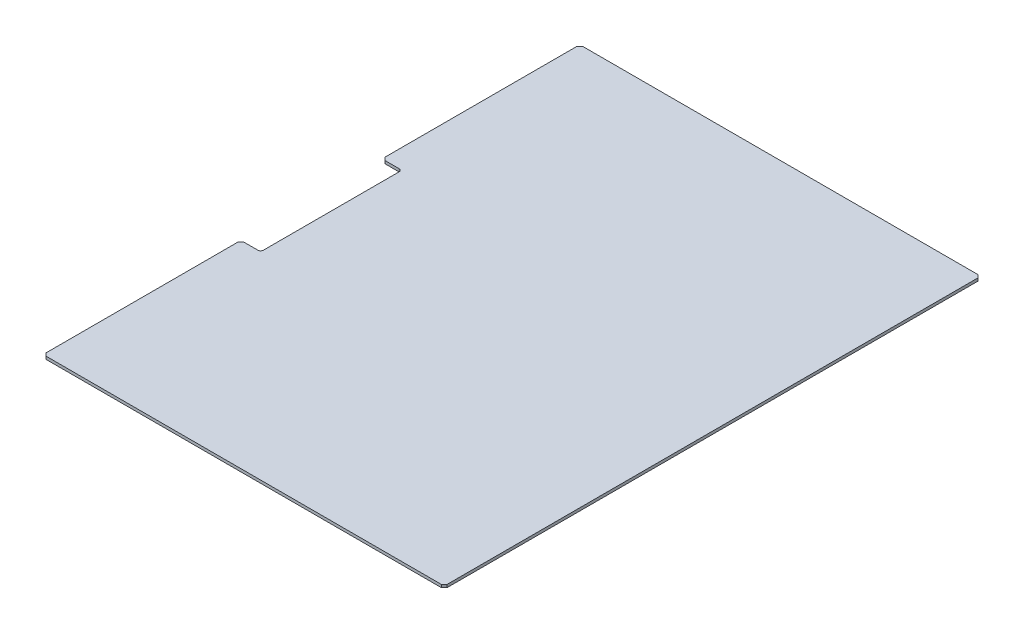
ISO-10303-21;
HEADER;
FILE_DESCRIPTION(('STEP AP214'),'2;1');
FILE_NAME('part.step','',(''),(''),'','','');
FILE_SCHEMA(('AUTOMOTIVE_DESIGN { 1 0 10303 214 1 1 1 1 }'));
ENDSEC;
DATA;
#1=APPLICATION_CONTEXT('core data for automotive mechanical design processes');
#2=APPLICATION_PROTOCOL_DEFINITION('international standard','automotive_design',2000,#1);
#3=PRODUCT_CONTEXT('',#1,'mechanical');
#4=PRODUCT('Part','Part','',(#3));
#5=PRODUCT_RELATED_PRODUCT_CATEGORY('part','',(#4));
#6=PRODUCT_DEFINITION_FORMATION('','',#4);
#7=PRODUCT_DEFINITION_CONTEXT('part definition',#1,'design');
#8=PRODUCT_DEFINITION('design','',#6,#7);
#9=PRODUCT_DEFINITION_SHAPE('','',#8);
#10=(LENGTH_UNIT() NAMED_UNIT(*) SI_UNIT(.MILLI.,.METRE.));
#11=(NAMED_UNIT(*) PLANE_ANGLE_UNIT() SI_UNIT($,.RADIAN.));
#12=(NAMED_UNIT(*) SI_UNIT($,.STERADIAN.) SOLID_ANGLE_UNIT());
#13=UNCERTAINTY_MEASURE_WITH_UNIT(LENGTH_MEASURE(1.E-05),#10,'distance_accuracy_value','');
#14=(GEOMETRIC_REPRESENTATION_CONTEXT(3) GLOBAL_UNCERTAINTY_ASSIGNED_CONTEXT((#13)) GLOBAL_UNIT_ASSIGNED_CONTEXT((#10,
#11,#12)) REPRESENTATION_CONTEXT('',''));
#15=CARTESIAN_POINT('',(0.,0.,0.));
#16=DIRECTION('',(0.,0.,1.));
#17=DIRECTION('',(1.,0.,0.));
#18=AXIS2_PLACEMENT_3D('',#15,#16,#17);
#19=CARTESIAN_POINT('',(50.8,-6.35,52.5536723434925));
#20=DIRECTION('',(-1.,0.,0.));
#21=DIRECTION('',(0.,0.,1.));
#22=AXIS2_PLACEMENT_3D('',#19,#20,#21);
#23=PLANE('',#22);
#24=DIRECTION('',(0.,0.,1.));
#25=VECTOR('',#24,1.);
#26=CARTESIAN_POINT('',(50.8,0.,52.5536723434925));
#27=LINE('',#26,#25);
#28=CARTESIAN_POINT('',(50.8,0.,768.35));
#29=VERTEX_POINT('',#28);
#30=CARTESIAN_POINT('',(50.8,0.,1200.15));
#31=VERTEX_POINT('',#30);
#32=EDGE_CURVE('E197',#29,#31,#27,.T.);
#33=ORIENTED_EDGE('',*,*,#32,.F.);
#34=DIRECTION('',(0.,-1.,0.));
#35=VECTOR('',#34,1.);
#36=CARTESIAN_POINT('',(50.8,-6.35,768.35));
#37=LINE('',#36,#35);
#38=CARTESIAN_POINT('',(50.8,-6.35,768.35));
#39=VERTEX_POINT('',#38);
#40=EDGE_CURVE('E171',#29,#39,#37,.T.);
#41=ORIENTED_EDGE('',*,*,#40,.T.);
#42=DIRECTION('',(0.,0.,1.));
#43=VECTOR('',#42,1.);
#44=CARTESIAN_POINT('',(50.8,-6.35,52.5536723434925));
#45=LINE('',#44,#43);
#46=CARTESIAN_POINT('',(50.8,-6.35,1200.15));
#47=VERTEX_POINT('',#46);
#48=EDGE_CURVE('E225',#39,#47,#45,.T.);
#49=ORIENTED_EDGE('',*,*,#48,.T.);
#50=DIRECTION('',(0.,1.,0.));
#51=VECTOR('',#50,1.);
#52=CARTESIAN_POINT('',(50.8,-6.35,1200.15));
#53=LINE('',#52,#51);
#54=EDGE_CURVE('E177',#47,#31,#53,.T.);
#55=ORIENTED_EDGE('',*,*,#54,.T.);
#56=EDGE_LOOP('',(#33,#41,#49,#55));
#57=FACE_BOUND('',#56,.T.);
#58=ADVANCED_FACE('F16',(#57),#23,.T.);
#59=CARTESIAN_POINT('',(121.105415511131,-6.35,762.));
#60=DIRECTION('',(0.,0.,1.));
#61=DIRECTION('',(1.,0.,0.));
#62=AXIS2_PLACEMENT_3D('',#59,#60,#61);
#63=PLANE('',#62);
#64=DIRECTION('',(1.,0.,0.));
#65=VECTOR('',#64,1.);
#66=CARTESIAN_POINT('',(121.105415511131,0.,762.));
#67=LINE('',#66,#65);
#68=CARTESIAN_POINT('',(57.15,0.,762.));
#69=VERTEX_POINT('',#68);
#70=CARTESIAN_POINT('',(88.9,0.,762.));
#71=VERTEX_POINT('',#70);
#72=EDGE_CURVE('E184',#69,#71,#67,.T.);
#73=ORIENTED_EDGE('',*,*,#72,.T.);
#74=DIRECTION('',(0.,1.,0.));
#75=VECTOR('',#74,1.);
#76=CARTESIAN_POINT('',(88.9,-6.35,762.));
#77=LINE('',#76,#75);
#78=CARTESIAN_POINT('',(88.9,-6.35,762.));
#79=VERTEX_POINT('',#78);
#80=EDGE_CURVE('E300',#71,#79,#77,.F.);
#81=ORIENTED_EDGE('',*,*,#80,.T.);
#82=DIRECTION('',(1.,0.,0.));
#83=VECTOR('',#82,1.);
#84=CARTESIAN_POINT('',(121.105415511131,-6.35,762.));
#85=LINE('',#84,#83);
#86=CARTESIAN_POINT('',(57.15,-6.35,762.));
#87=VERTEX_POINT('',#86);
#88=EDGE_CURVE('E187',#87,#79,#85,.T.);
#89=ORIENTED_EDGE('',*,*,#88,.F.);
#90=DIRECTION('',(0.,1.,0.));
#91=VECTOR('',#90,1.);
#92=CARTESIAN_POINT('',(57.15,0.,762.));
#93=LINE('',#92,#91);
#94=EDGE_CURVE('E170',#87,#69,#93,.T.);
#95=ORIENTED_EDGE('',*,*,#94,.T.);
#96=EDGE_LOOP('',(#73,#81,#89,#95));
#97=FACE_BOUND('',#96,.T.);
#98=ADVANCED_FACE('F183',(#97),#63,.F.);
#99=CARTESIAN_POINT('',(95.25,-6.35,626.005172729492));
#100=DIRECTION('',(1.,0.,0.));
#101=DIRECTION('',(0.,0.,-1.));
#102=AXIS2_PLACEMENT_3D('',#99,#100,#101);
#103=PLANE('',#102);
#104=DIRECTION('',(0.,0.,-1.));
#105=VECTOR('',#104,1.);
#106=CARTESIAN_POINT('',(95.25,-6.35,626.005172729492));
#107=LINE('',#106,#105);
#108=CARTESIAN_POINT('',(95.25,-6.35,755.65));
#109=VERTEX_POINT('',#108);
#110=CARTESIAN_POINT('',(95.25,-6.35,450.85));
#111=VERTEX_POINT('',#110);
#112=EDGE_CURVE('E324',#109,#111,#107,.T.);
#113=ORIENTED_EDGE('',*,*,#112,.F.);
#114=DIRECTION('',(0.,1.,0.));
#115=VECTOR('',#114,1.);
#116=CARTESIAN_POINT('',(95.25,0.,755.65));
#117=LINE('',#116,#115);
#118=CARTESIAN_POINT('',(95.25,0.,755.65));
#119=VERTEX_POINT('',#118);
#120=EDGE_CURVE('E296',#109,#119,#117,.T.);
#121=ORIENTED_EDGE('',*,*,#120,.T.);
#122=DIRECTION('',(0.,0.,-1.));
#123=VECTOR('',#122,1.);
#124=CARTESIAN_POINT('',(95.25,0.,626.005172729492));
#125=LINE('',#124,#123);
#126=CARTESIAN_POINT('',(95.25,0.,450.85));
#127=VERTEX_POINT('',#126);
#128=EDGE_CURVE('E196',#119,#127,#125,.T.);
#129=ORIENTED_EDGE('',*,*,#128,.T.);
#130=DIRECTION('',(0.,1.,0.));
#131=VECTOR('',#130,1.);
#132=CARTESIAN_POINT('',(95.25,-6.35,450.85));
#133=LINE('',#132,#131);
#134=EDGE_CURVE('E293',#127,#111,#133,.F.);
#135=ORIENTED_EDGE('',*,*,#134,.T.);
#136=EDGE_LOOP('',(#113,#121,#129,#135));
#137=FACE_BOUND('',#136,.T.);
#138=ADVANCED_FACE('F315',(#137),#103,.F.);
#139=CARTESIAN_POINT('',(121.105415511131,-6.35,444.5));
#140=DIRECTION('',(0.,0.,1.));
#141=DIRECTION('',(1.,0.,0.));
#142=AXIS2_PLACEMENT_3D('',#139,#140,#141);
#143=PLANE('',#142);
#144=DIRECTION('',(1.,0.,0.));
#145=VECTOR('',#144,1.);
#146=CARTESIAN_POINT('',(121.105415511131,-6.35,444.5));
#147=LINE('',#146,#145);
#148=CARTESIAN_POINT('',(57.15,-6.35,444.5));
#149=VERTEX_POINT('',#148);
#150=CARTESIAN_POINT('',(88.9,-6.35,444.5));
#151=VERTEX_POINT('',#150);
#152=EDGE_CURVE('E320',#149,#151,#147,.T.);
#153=ORIENTED_EDGE('',*,*,#152,.T.);
#154=DIRECTION('',(0.,1.,0.));
#155=VECTOR('',#154,1.);
#156=CARTESIAN_POINT('',(88.9,-6.35,444.5));
#157=LINE('',#156,#155);
#158=CARTESIAN_POINT('',(88.9,0.,444.5));
#159=VERTEX_POINT('',#158);
#160=EDGE_CURVE('E303',#151,#159,#157,.T.);
#161=ORIENTED_EDGE('',*,*,#160,.T.);
#162=DIRECTION('',(1.,0.,0.));
#163=VECTOR('',#162,1.);
#164=CARTESIAN_POINT('',(121.105415511131,0.,444.5));
#165=LINE('',#164,#163);
#166=CARTESIAN_POINT('',(57.15,0.,444.5));
#167=VERTEX_POINT('',#166);
#168=EDGE_CURVE('E204',#167,#159,#165,.T.);
#169=ORIENTED_EDGE('',*,*,#168,.F.);
#170=DIRECTION('',(0.,-1.,0.));
#171=VECTOR('',#170,1.);
#172=CARTESIAN_POINT('',(57.15,-6.35,444.5));
#173=LINE('',#172,#171);
#174=EDGE_CURVE('E269',#167,#149,#173,.T.);
#175=ORIENTED_EDGE('',*,*,#174,.T.);
#176=EDGE_LOOP('',(#153,#161,#169,#175));
#177=FACE_BOUND('',#176,.T.);
#178=ADVANCED_FACE('F318',(#177),#143,.T.);
#179=CARTESIAN_POINT('',(50.8,-6.35,6.35));
#180=VERTEX_POINT('',#179);
#181=CARTESIAN_POINT('',(50.8,-6.35,438.15));
#182=VERTEX_POINT('',#181);
#183=EDGE_CURVE('E323',#180,#182,#45,.T.);
#184=ORIENTED_EDGE('',*,*,#183,.T.);
#185=DIRECTION('',(0.,1.,0.));
#186=VECTOR('',#185,1.);
#187=CARTESIAN_POINT('',(50.8,-6.35,438.15));
#188=LINE('',#187,#186);
#189=CARTESIAN_POINT('',(50.8,0.,438.15));
#190=VERTEX_POINT('',#189);
#191=EDGE_CURVE('E265',#182,#190,#188,.T.);
#192=ORIENTED_EDGE('',*,*,#191,.T.);
#193=CARTESIAN_POINT('',(50.8,0.,6.35));
#194=VERTEX_POINT('',#193);
#195=EDGE_CURVE('E208',#194,#190,#27,.T.);
#196=ORIENTED_EDGE('',*,*,#195,.F.);
#197=DIRECTION('',(0.,-1.,0.));
#198=VECTOR('',#197,1.);
#199=CARTESIAN_POINT('',(50.8,-6.35,6.35));
#200=LINE('',#199,#198);
#201=EDGE_CURVE('E262',#194,#180,#200,.T.);
#202=ORIENTED_EDGE('',*,*,#201,.T.);
#203=EDGE_LOOP('',(#184,#192,#196,#202));
#204=FACE_BOUND('',#203,.T.);
#205=ADVANCED_FACE('F376',(#204),#23,.T.);
#206=CARTESIAN_POINT('',(123.701680451632,-6.35,0.));
#207=DIRECTION('',(0.,0.,1.));
#208=DIRECTION('',(1.,0.,0.));
#209=AXIS2_PLACEMENT_3D('',#206,#207,#208);
#210=PLANE('',#209);
#211=DIRECTION('',(1.,0.,0.));
#212=VECTOR('',#211,1.);
#213=CARTESIAN_POINT('',(123.701680451632,-6.35,0.));
#214=LINE('',#213,#212);
#215=CARTESIAN_POINT('',(57.15,-6.35,0.));
#216=VERTEX_POINT('',#215);
#217=CARTESIAN_POINT('',(946.15,-6.35,0.));
#218=VERTEX_POINT('',#217);
#219=EDGE_CURVE('E329',#216,#218,#214,.T.);
#220=ORIENTED_EDGE('',*,*,#219,.F.);
#221=DIRECTION('',(0.,1.,0.));
#222=VECTOR('',#221,1.);
#223=CARTESIAN_POINT('',(57.15,0.,0.));
#224=LINE('',#223,#222);
#225=CARTESIAN_POINT('',(57.15,0.,0.));
#226=VERTEX_POINT('',#225);
#227=EDGE_CURVE('E275',#216,#226,#224,.T.);
#228=ORIENTED_EDGE('',*,*,#227,.T.);
#229=DIRECTION('',(1.,0.,0.));
#230=VECTOR('',#229,1.);
#231=CARTESIAN_POINT('',(123.701680451632,0.,0.));
#232=LINE('',#231,#230);
#233=CARTESIAN_POINT('',(946.15,0.,0.));
#234=VERTEX_POINT('',#233);
#235=EDGE_CURVE('E214',#226,#234,#232,.T.);
#236=ORIENTED_EDGE('',*,*,#235,.T.);
#237=DIRECTION('',(0.,-1.,0.));
#238=VECTOR('',#237,1.);
#239=CARTESIAN_POINT('',(946.15,-6.35,0.));
#240=LINE('',#239,#238);
#241=EDGE_CURVE('E272',#234,#218,#240,.T.);
#242=ORIENTED_EDGE('',*,*,#241,.T.);
#243=EDGE_LOOP('',(#220,#228,#236,#242));
#244=FACE_BOUND('',#243,.T.);
#245=ADVANCED_FACE('F367',(#244),#210,.F.);
#246=CARTESIAN_POINT('',(952.5,-6.35,52.5536723434928));
#247=DIRECTION('',(-1.,0.,0.));
#248=DIRECTION('',(0.,0.,1.));
#249=AXIS2_PLACEMENT_3D('',#246,#247,#248);
#250=PLANE('',#249);
#251=DIRECTION('',(0.,0.,1.));
#252=VECTOR('',#251,1.);
#253=CARTESIAN_POINT('',(952.5,-6.35,52.5536723434928));
#254=LINE('',#253,#252);
#255=CARTESIAN_POINT('',(952.5,-6.35,6.35));
#256=VERTEX_POINT('',#255);
#257=CARTESIAN_POINT('',(952.5,-6.35,1200.15));
#258=VERTEX_POINT('',#257);
#259=EDGE_CURVE('E338',#256,#258,#254,.T.);
#260=ORIENTED_EDGE('',*,*,#259,.F.);
#261=DIRECTION('',(0.,1.,0.));
#262=VECTOR('',#261,1.);
#263=CARTESIAN_POINT('',(952.5,-6.35,6.35));
#264=LINE('',#263,#262);
#265=CARTESIAN_POINT('',(952.5,0.,6.35));
#266=VERTEX_POINT('',#265);
#267=EDGE_CURVE('E282',#256,#266,#264,.T.);
#268=ORIENTED_EDGE('',*,*,#267,.T.);
#269=DIRECTION('',(0.,0.,1.));
#270=VECTOR('',#269,1.);
#271=CARTESIAN_POINT('',(952.5,0.,52.5536723434928));
#272=LINE('',#271,#270);
#273=CARTESIAN_POINT('',(952.5,0.,1200.15));
#274=VERTEX_POINT('',#273);
#275=EDGE_CURVE('E218',#266,#274,#272,.T.);
#276=ORIENTED_EDGE('',*,*,#275,.T.);
#277=DIRECTION('',(0.,-1.,0.));
#278=VECTOR('',#277,1.);
#279=CARTESIAN_POINT('',(952.5,-6.35,1200.15));
#280=LINE('',#279,#278);
#281=EDGE_CURVE('E279',#274,#258,#280,.T.);
#282=ORIENTED_EDGE('',*,*,#281,.T.);
#283=EDGE_LOOP('',(#260,#268,#276,#282));
#284=FACE_BOUND('',#283,.T.);
#285=ADVANCED_FACE('F358',(#284),#250,.F.);
#286=CARTESIAN_POINT('',(123.701680451632,-6.35,1206.5));
#287=DIRECTION('',(0.,0.,1.));
#288=DIRECTION('',(1.,0.,0.));
#289=AXIS2_PLACEMENT_3D('',#286,#287,#288);
#290=PLANE('',#289);
#291=DIRECTION('',(1.,0.,0.));
#292=VECTOR('',#291,1.);
#293=CARTESIAN_POINT('',(123.701680451632,0.,1206.5));
#294=LINE('',#293,#292);
#295=CARTESIAN_POINT('',(57.15,0.,1206.5));
#296=VERTEX_POINT('',#295);
#297=CARTESIAN_POINT('',(946.15,0.,1206.5));
#298=VERTEX_POINT('',#297);
#299=EDGE_CURVE('E222',#296,#298,#294,.T.);
#300=ORIENTED_EDGE('',*,*,#299,.F.);
#301=DIRECTION('',(0.,-1.,0.));
#302=VECTOR('',#301,1.);
#303=CARTESIAN_POINT('',(57.15,-6.35,1206.5));
#304=LINE('',#303,#302);
#305=CARTESIAN_POINT('',(57.15,-6.35,1206.5));
#306=VERTEX_POINT('',#305);
#307=EDGE_CURVE('E290',#296,#306,#304,.T.);
#308=ORIENTED_EDGE('',*,*,#307,.T.);
#309=DIRECTION('',(1.,0.,0.));
#310=VECTOR('',#309,1.);
#311=CARTESIAN_POINT('',(123.701680451632,-6.35,1206.5));
#312=LINE('',#311,#310);
#313=CARTESIAN_POINT('',(946.15,-6.35,1206.5));
#314=VERTEX_POINT('',#313);
#315=EDGE_CURVE('E190',#306,#314,#312,.T.);
#316=ORIENTED_EDGE('',*,*,#315,.T.);
#317=DIRECTION('',(0.,1.,0.));
#318=VECTOR('',#317,1.);
#319=CARTESIAN_POINT('',(946.15,0.,1206.5));
#320=LINE('',#319,#318);
#321=EDGE_CURVE('E286',#314,#298,#320,.T.);
#322=ORIENTED_EDGE('',*,*,#321,.T.);
#323=EDGE_LOOP('',(#300,#308,#316,#322));
#324=FACE_BOUND('',#323,.T.);
#325=ADVANCED_FACE('F348',(#324),#290,.T.);
#326=CARTESIAN_POINT('',(501.65,-6.35,603.25));
#327=DIRECTION('',(0.,-1.,0.));
#328=DIRECTION('',(1.,0.,0.));
#329=AXIS2_PLACEMENT_3D('',#326,#327,#328);
#330=PLANE('',#329);
#331=ORIENTED_EDGE('',*,*,#48,.F.);
#332=DIRECTION('',(0.707106781186557,0.,-0.707106781186538));
#333=VECTOR('',#332,1.);
#334=CARTESIAN_POINT('',(358.775000000005,-6.35,460.375));
#335=LINE('',#334,#333);
#336=EDGE_CURVE('E259',#39,#87,#335,.T.);
#337=ORIENTED_EDGE('',*,*,#336,.T.);
#338=ORIENTED_EDGE('',*,*,#88,.T.);
#339=CARTESIAN_POINT('',(88.9,-6.35,755.65));
#340=DIRECTION('',(0.,-1.,0.));
#341=DIRECTION('',(0.,0.,-1.));
#342=AXIS2_PLACEMENT_3D('',#339,#340,#341);
#343=CIRCLE('',#342,6.35);
#344=EDGE_CURVE('E308',#79,#109,#343,.F.);
#345=ORIENTED_EDGE('',*,*,#344,.T.);
#346=ORIENTED_EDGE('',*,*,#112,.T.);
#347=CARTESIAN_POINT('',(88.9,-6.35,450.85));
#348=DIRECTION('',(0.,-1.,0.));
#349=DIRECTION('',(0.,0.,-1.));
#350=AXIS2_PLACEMENT_3D('',#347,#348,#349);
#351=CIRCLE('',#350,6.35);
#352=EDGE_CURVE('E11',#111,#151,#351,.F.);
#353=ORIENTED_EDGE('',*,*,#352,.T.);
#354=ORIENTED_EDGE('',*,*,#152,.F.);
#355=DIRECTION('',(0.707106781186547,0.,0.707106781186548));
#356=VECTOR('',#355,1.);
#357=CARTESIAN_POINT('',(358.775,-6.35,746.125));
#358=LINE('',#357,#356);
#359=EDGE_CURVE('E256',#149,#182,#358,.F.);
#360=ORIENTED_EDGE('',*,*,#359,.T.);
#361=ORIENTED_EDGE('',*,*,#183,.F.);
#362=DIRECTION('',(0.707106781186548,0.,-0.707106781186548));
#363=VECTOR('',#362,1.);
#364=CARTESIAN_POINT('',(-22.225,-6.35,79.375));
#365=LINE('',#364,#363);
#366=EDGE_CURVE('E253',#180,#216,#365,.T.);
#367=ORIENTED_EDGE('',*,*,#366,.T.);
#368=ORIENTED_EDGE('',*,*,#219,.T.);
#369=DIRECTION('',(-0.707106781186545,0.,-0.70710678118655));
#370=VECTOR('',#369,1.);
#371=CARTESIAN_POINT('',(1025.525,-6.35,79.375000000002));
#372=LINE('',#371,#370);
#373=EDGE_CURVE('E250',#218,#256,#372,.F.);
#374=ORIENTED_EDGE('',*,*,#373,.T.);
#375=ORIENTED_EDGE('',*,*,#259,.T.);
#376=DIRECTION('',(-0.707106781186529,0.,0.707106781186566));
#377=VECTOR('',#376,1.);
#378=CARTESIAN_POINT('',(1025.52500000001,-6.35,1127.12499999998));
#379=LINE('',#378,#377);
#380=EDGE_CURVE('E244',#258,#314,#379,.T.);
#381=ORIENTED_EDGE('',*,*,#380,.T.);
#382=ORIENTED_EDGE('',*,*,#315,.F.);
#383=DIRECTION('',(0.707106781186532,0.,0.707106781186563));
#384=VECTOR('',#383,1.);
#385=CARTESIAN_POINT('',(-22.2250000000101,-6.35,1127.12499999999));
#386=LINE('',#385,#384);
#387=EDGE_CURVE('E247',#306,#47,#386,.F.);
#388=ORIENTED_EDGE('',*,*,#387,.T.);
#389=EDGE_LOOP('',(#331,#337,#338,#345,#346,#353,#354,#360,#361,#367,#368,#374,#375,#381,#382,#388));
#390=FACE_BOUND('',#389,.T.);
#391=ADVANCED_FACE('F468',(#390),#330,.T.);
#392=CARTESIAN_POINT('',(501.65,0.,603.25));
#393=DIRECTION('',(0.,-1.,0.));
#394=DIRECTION('',(1.,0.,0.));
#395=AXIS2_PLACEMENT_3D('',#392,#393,#394);
#396=PLANE('',#395);
#397=ORIENTED_EDGE('',*,*,#72,.F.);
#398=DIRECTION('',(-0.707106781186557,0.,0.707106781186538));
#399=VECTOR('',#398,1.);
#400=CARTESIAN_POINT('',(57.15,0.,762.));
#401=LINE('',#400,#399);
#402=EDGE_CURVE('E166',#69,#29,#401,.T.);
#403=ORIENTED_EDGE('',*,*,#402,.T.);
#404=ORIENTED_EDGE('',*,*,#32,.T.);
#405=DIRECTION('',(-0.707106781186532,0.,-0.707106781186563));
#406=VECTOR('',#405,1.);
#407=CARTESIAN_POINT('',(50.8,0.,1200.15));
#408=LINE('',#407,#406);
#409=EDGE_CURVE('E229',#31,#296,#408,.F.);
#410=ORIENTED_EDGE('',*,*,#409,.T.);
#411=ORIENTED_EDGE('',*,*,#299,.T.);
#412=DIRECTION('',(0.707106781186529,0.,-0.707106781186566));
#413=VECTOR('',#412,1.);
#414=CARTESIAN_POINT('',(946.15,0.,1206.5));
#415=LINE('',#414,#413);
#416=EDGE_CURVE('E189',#298,#274,#415,.T.);
#417=ORIENTED_EDGE('',*,*,#416,.T.);
#418=ORIENTED_EDGE('',*,*,#275,.F.);
#419=DIRECTION('',(0.707106781186545,0.,0.70710678118655));
#420=VECTOR('',#419,1.);
#421=CARTESIAN_POINT('',(952.5,0.,6.35));
#422=LINE('',#421,#420);
#423=EDGE_CURVE('E232',#266,#234,#422,.F.);
#424=ORIENTED_EDGE('',*,*,#423,.T.);
#425=ORIENTED_EDGE('',*,*,#235,.F.);
#426=DIRECTION('',(-0.707106781186548,0.,0.707106781186548));
#427=VECTOR('',#426,1.);
#428=CARTESIAN_POINT('',(57.15,0.,0.));
#429=LINE('',#428,#427);
#430=EDGE_CURVE('E235',#226,#194,#429,.T.);
#431=ORIENTED_EDGE('',*,*,#430,.T.);
#432=ORIENTED_EDGE('',*,*,#195,.T.);
#433=DIRECTION('',(-0.707106781186547,0.,-0.707106781186548));
#434=VECTOR('',#433,1.);
#435=CARTESIAN_POINT('',(50.8,0.,438.15));
#436=LINE('',#435,#434);
#437=EDGE_CURVE('E178',#190,#167,#436,.F.);
#438=ORIENTED_EDGE('',*,*,#437,.T.);
#439=ORIENTED_EDGE('',*,*,#168,.T.);
#440=CARTESIAN_POINT('',(88.9,0.,450.85));
#441=DIRECTION('',(0.,-1.,0.));
#442=DIRECTION('',(0.,0.,-1.));
#443=AXIS2_PLACEMENT_3D('',#440,#441,#442);
#444=CIRCLE('',#443,6.35);
#445=EDGE_CURVE('E25',#159,#127,#444,.T.);
#446=ORIENTED_EDGE('',*,*,#445,.T.);
#447=ORIENTED_EDGE('',*,*,#128,.F.);
#448=CARTESIAN_POINT('',(88.9,0.,755.65));
#449=DIRECTION('',(0.,-1.,0.));
#450=DIRECTION('',(0.,0.,-1.));
#451=AXIS2_PLACEMENT_3D('',#448,#449,#450);
#452=CIRCLE('',#451,6.35);
#453=EDGE_CURVE('E194',#119,#71,#452,.T.);
#454=ORIENTED_EDGE('',*,*,#453,.T.);
#455=EDGE_LOOP('',(#397,#403,#404,#410,#411,#417,#418,#424,#425,#431,#432,#438,#439,#446,#447,#454));
#456=FACE_BOUND('',#455,.T.);
#457=ADVANCED_FACE('F192',(#456),#396,.F.);
#458=CARTESIAN_POINT('',(57.15,-6.35,762.));
#459=DIRECTION('',(-0.707106781186538,0.,-0.707106781186557));
#460=DIRECTION('',(0.,-1.,0.));
#461=AXIS2_PLACEMENT_3D('',#458,#459,#460);
#462=PLANE('',#461);
#463=ORIENTED_EDGE('',*,*,#336,.F.);
#464=ORIENTED_EDGE('',*,*,#40,.F.);
#465=ORIENTED_EDGE('',*,*,#402,.F.);
#466=ORIENTED_EDGE('',*,*,#94,.F.);
#467=EDGE_LOOP('',(#463,#464,#465,#466));
#468=FACE_BOUND('',#467,.T.);
#469=ADVANCED_FACE('F169',(#468),#462,.T.);
#470=CARTESIAN_POINT('',(50.8,-6.35,438.15));
#471=DIRECTION('',(0.707106781186548,0.,-0.707106781186547));
#472=DIRECTION('',(0.,1.,0.));
#473=AXIS2_PLACEMENT_3D('',#470,#471,#472);
#474=PLANE('',#473);
#475=ORIENTED_EDGE('',*,*,#359,.F.);
#476=ORIENTED_EDGE('',*,*,#174,.F.);
#477=ORIENTED_EDGE('',*,*,#437,.F.);
#478=ORIENTED_EDGE('',*,*,#191,.F.);
#479=EDGE_LOOP('',(#475,#476,#477,#478));
#480=FACE_BOUND('',#479,.T.);
#481=ADVANCED_FACE('F402',(#480),#474,.F.);
#482=CARTESIAN_POINT('',(57.15,-6.35,0.));
#483=DIRECTION('',(-0.707106781186548,0.,-0.707106781186548));
#484=DIRECTION('',(0.,-1.,0.));
#485=AXIS2_PLACEMENT_3D('',#482,#483,#484);
#486=PLANE('',#485);
#487=ORIENTED_EDGE('',*,*,#366,.F.);
#488=ORIENTED_EDGE('',*,*,#201,.F.);
#489=ORIENTED_EDGE('',*,*,#430,.F.);
#490=ORIENTED_EDGE('',*,*,#227,.F.);
#491=EDGE_LOOP('',(#487,#488,#489,#490));
#492=FACE_BOUND('',#491,.T.);
#493=ADVANCED_FACE('F371',(#492),#486,.T.);
#494=CARTESIAN_POINT('',(952.5,-6.35,6.35));
#495=DIRECTION('',(-0.70710678118655,0.,0.707106781186545));
#496=DIRECTION('',(0.,1.,0.));
#497=AXIS2_PLACEMENT_3D('',#494,#495,#496);
#498=PLANE('',#497);
#499=ORIENTED_EDGE('',*,*,#373,.F.);
#500=ORIENTED_EDGE('',*,*,#241,.F.);
#501=ORIENTED_EDGE('',*,*,#423,.F.);
#502=ORIENTED_EDGE('',*,*,#267,.F.);
#503=EDGE_LOOP('',(#499,#500,#501,#502));
#504=FACE_BOUND('',#503,.T.);
#505=ADVANCED_FACE('F362',(#504),#498,.F.);
#506=CARTESIAN_POINT('',(50.8,-6.35,1200.15));
#507=DIRECTION('',(0.707106781186563,0.,-0.707106781186532));
#508=DIRECTION('',(0.,1.,0.));
#509=AXIS2_PLACEMENT_3D('',#506,#507,#508);
#510=PLANE('',#509);
#511=ORIENTED_EDGE('',*,*,#387,.F.);
#512=ORIENTED_EDGE('',*,*,#307,.F.);
#513=ORIENTED_EDGE('',*,*,#409,.F.);
#514=ORIENTED_EDGE('',*,*,#54,.F.);
#515=EDGE_LOOP('',(#511,#512,#513,#514));
#516=FACE_BOUND('',#515,.T.);
#517=ADVANCED_FACE('F413',(#516),#510,.F.);
#518=CARTESIAN_POINT('',(946.15,-6.35,1206.5));
#519=DIRECTION('',(0.707106781186566,0.,0.707106781186529));
#520=DIRECTION('',(0.,-1.,0.));
#521=AXIS2_PLACEMENT_3D('',#518,#519,#520);
#522=PLANE('',#521);
#523=ORIENTED_EDGE('',*,*,#380,.F.);
#524=ORIENTED_EDGE('',*,*,#281,.F.);
#525=ORIENTED_EDGE('',*,*,#416,.F.);
#526=ORIENTED_EDGE('',*,*,#321,.F.);
#527=EDGE_LOOP('',(#523,#524,#525,#526));
#528=FACE_BOUND('',#527,.T.);
#529=ADVANCED_FACE('F353',(#528),#522,.T.);
#530=CARTESIAN_POINT('',(88.9,-6.35,755.65));
#531=DIRECTION('',(0.,-1.,0.));
#532=DIRECTION('',(0.,0.,-1.));
#533=AXIS2_PLACEMENT_3D('',#530,#531,#532);
#534=CYLINDRICAL_SURFACE('',#533,6.35);
#535=ORIENTED_EDGE('',*,*,#344,.F.);
#536=ORIENTED_EDGE('',*,*,#80,.F.);
#537=ORIENTED_EDGE('',*,*,#453,.F.);
#538=ORIENTED_EDGE('',*,*,#120,.F.);
#539=EDGE_LOOP('',(#535,#536,#537,#538));
#540=FACE_BOUND('',#539,.T.);
#541=ADVANCED_FACE('F431',(#540),#534,.F.);
#542=CARTESIAN_POINT('',(88.9,-6.35,450.85));
#543=DIRECTION('',(0.,1.,0.));
#544=DIRECTION('',(0.,0.,1.));
#545=AXIS2_PLACEMENT_3D('',#542,#543,#544);
#546=CYLINDRICAL_SURFACE('',#545,6.35);
#547=ORIENTED_EDGE('',*,*,#352,.F.);
#548=ORIENTED_EDGE('',*,*,#134,.F.);
#549=ORIENTED_EDGE('',*,*,#445,.F.);
#550=ORIENTED_EDGE('',*,*,#160,.F.);
#551=EDGE_LOOP('',(#547,#548,#549,#550));
#552=FACE_BOUND('',#551,.T.);
#553=ADVANCED_FACE('F18',(#552),#546,.F.);
#554=CLOSED_SHELL('',(#58,#98,#138,#178,#205,#245,#285,#325,#391,#457,#469,#481,#493,#505,#517,
#529,#541,#553));
#555=MANIFOLD_SOLID_BREP('B1',#554);
#556=ADVANCED_BREP_SHAPE_REPRESENTATION('',(#18,#555),#14);
#557=SHAPE_DEFINITION_REPRESENTATION(#9,#556);
ENDSEC;
END-ISO-10303-21;
